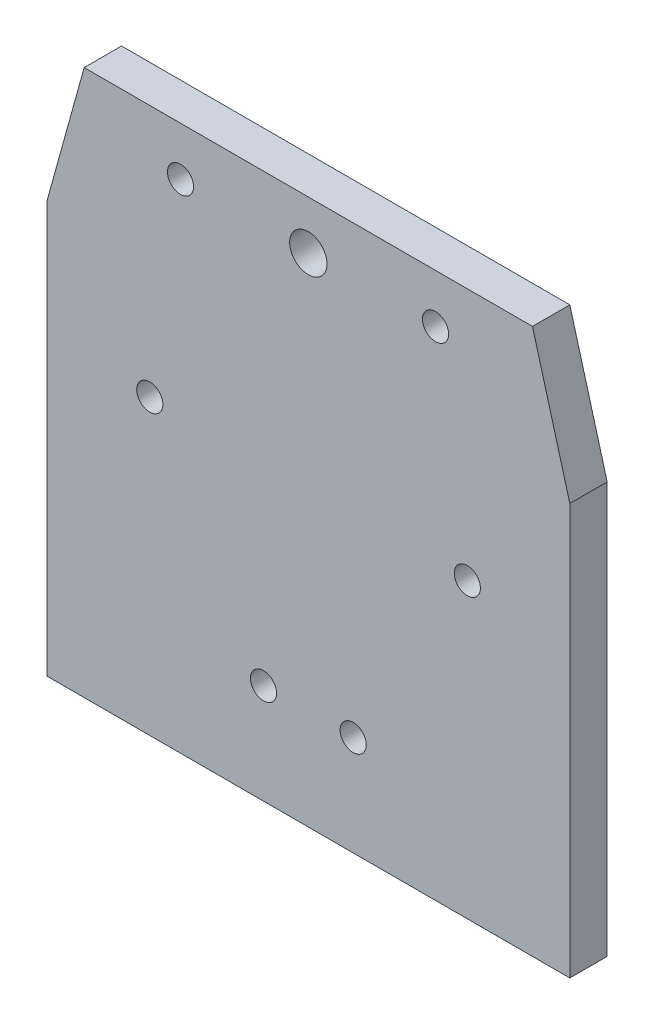
ISO-10303-21;
HEADER;
FILE_DESCRIPTION(('STEP AP214'),'2;1');
FILE_NAME('part.step','',(''),(''),'','','');
FILE_SCHEMA(('AUTOMOTIVE_DESIGN { 1 0 10303 214 1 1 1 1 }'));
ENDSEC;
DATA;
#1=APPLICATION_CONTEXT('core data for automotive mechanical design processes');
#2=APPLICATION_PROTOCOL_DEFINITION('international standard','automotive_design',2000,#1);
#3=PRODUCT_CONTEXT('',#1,'mechanical');
#4=PRODUCT('Part','Part','',(#3));
#5=PRODUCT_RELATED_PRODUCT_CATEGORY('part','',(#4));
#6=PRODUCT_DEFINITION_FORMATION('','',#4);
#7=PRODUCT_DEFINITION_CONTEXT('part definition',#1,'design');
#8=PRODUCT_DEFINITION('design','',#6,#7);
#9=PRODUCT_DEFINITION_SHAPE('','',#8);
#10=(LENGTH_UNIT() NAMED_UNIT(*) SI_UNIT(.MILLI.,.METRE.));
#11=(NAMED_UNIT(*) PLANE_ANGLE_UNIT() SI_UNIT($,.RADIAN.));
#12=(NAMED_UNIT(*) SI_UNIT($,.STERADIAN.) SOLID_ANGLE_UNIT());
#13=UNCERTAINTY_MEASURE_WITH_UNIT(LENGTH_MEASURE(1.E-05),#10,'distance_accuracy_value','');
#14=(GEOMETRIC_REPRESENTATION_CONTEXT(3) GLOBAL_UNCERTAINTY_ASSIGNED_CONTEXT((#13)) GLOBAL_UNIT_ASSIGNED_CONTEXT((#10,
#11,#12)) REPRESENTATION_CONTEXT('',''));
#15=CARTESIAN_POINT('',(0.,0.,0.));
#16=DIRECTION('',(0.,0.,1.));
#17=DIRECTION('',(1.,0.,0.));
#18=AXIS2_PLACEMENT_3D('',#15,#16,#17);
#19=CARTESIAN_POINT('',(0.,0.,5.));
#20=DIRECTION('',(0.,0.,-1.));
#21=DIRECTION('',(-1.,0.,0.));
#22=AXIS2_PLACEMENT_3D('',#19,#20,#21);
#23=PLANE('',#22);
#24=DIRECTION('',(-0.267261241912419,-0.963624111659433,0.));
#25=VECTOR('',#24,1.);
#26=CARTESIAN_POINT('',(364.942546989887,291.200534555619,5.));
#27=LINE('',#26,#25);
#28=CARTESIAN_POINT('',(369.942546989887,309.228290932939,5.));
#29=VERTEX_POINT('',#28);
#30=CARTESIAN_POINT('',(364.942546989887,291.200534555619,5.));
#31=VERTEX_POINT('',#30);
#32=EDGE_CURVE('E129',#29,#31,#27,.T.);
#33=ORIENTED_EDGE('',*,*,#32,.T.);
#34=DIRECTION('',(0.,-1.,0.));
#35=VECTOR('',#34,1.);
#36=CARTESIAN_POINT('',(364.942546989887,236.200534555619,5.));
#37=LINE('',#36,#35);
#38=CARTESIAN_POINT('',(364.942546989887,236.200534555619,5.));
#39=VERTEX_POINT('',#38);
#40=EDGE_CURVE('E87',#31,#39,#37,.T.);
#41=ORIENTED_EDGE('',*,*,#40,.T.);
#42=DIRECTION('',(1.,0.,0.));
#43=VECTOR('',#42,1.);
#44=CARTESIAN_POINT('',(434.942546989887,236.200534555619,5.));
#45=LINE('',#44,#43);
#46=CARTESIAN_POINT('',(434.942546989887,236.200534555619,5.));
#47=VERTEX_POINT('',#46);
#48=EDGE_CURVE('E100',#39,#47,#45,.T.);
#49=ORIENTED_EDGE('',*,*,#48,.T.);
#50=DIRECTION('',(0.,1.,0.));
#51=VECTOR('',#50,1.);
#52=CARTESIAN_POINT('',(434.942546989887,291.200534555619,5.));
#53=LINE('',#52,#51);
#54=CARTESIAN_POINT('',(434.942546989887,291.200534555619,5.));
#55=VERTEX_POINT('',#54);
#56=EDGE_CURVE('E94',#47,#55,#53,.T.);
#57=ORIENTED_EDGE('',*,*,#56,.T.);
#58=DIRECTION('',(-0.267261241912417,0.963624111659434,0.));
#59=VECTOR('',#58,1.);
#60=CARTESIAN_POINT('',(434.942546989887,291.200534555619,5.));
#61=LINE('',#60,#59);
#62=CARTESIAN_POINT('',(429.942546989887,309.228290932939,5.));
#63=VERTEX_POINT('',#62);
#64=EDGE_CURVE('E98',#55,#63,#61,.T.);
#65=ORIENTED_EDGE('',*,*,#64,.T.);
#66=DIRECTION('',(-1.,0.,0.));
#67=VECTOR('',#66,1.);
#68=CARTESIAN_POINT('',(369.942546989887,309.228290932939,5.));
#69=LINE('',#68,#67);
#70=EDGE_CURVE('E50',#63,#29,#69,.T.);
#71=ORIENTED_EDGE('',*,*,#70,.T.);
#72=EDGE_LOOP('',(#33,#41,#49,#57,#65,#71));
#73=FACE_BOUND('',#72,.T.);
#74=CARTESIAN_POINT('',(421.22462876424,275.399946991282,5.));
#75=DIRECTION('',(0.,0.,1.));
#76=DIRECTION('',(1.,0.,0.));
#77=AXIS2_PLACEMENT_3D('',#74,#75,#76);
#78=CIRCLE('',#77,1.74999999999998);
#79=CARTESIAN_POINT('',(422.97462876424,275.399946991282,5.));
#80=VERTEX_POINT('',#79);
#81=EDGE_CURVE('E122',#80,#80,#78,.T.);
#82=ORIENTED_EDGE('',*,*,#81,.F.);
#83=EDGE_LOOP('',(#82));
#84=FACE_BOUND('',#83,.T.);
#85=CARTESIAN_POINT('',(378.72464227775,275.433838704496,5.));
#86=DIRECTION('',(0.,0.,1.));
#87=DIRECTION('',(1.,0.,0.));
#88=AXIS2_PLACEMENT_3D('',#85,#86,#87);
#89=CIRCLE('',#88,1.74999999999998);
#90=CARTESIAN_POINT('',(380.47464227775,275.433838704496,5.));
#91=VERTEX_POINT('',#90);
#92=EDGE_CURVE('E223',#91,#91,#89,.T.);
#93=ORIENTED_EDGE('',*,*,#92,.F.);
#94=EDGE_LOOP('',(#93));
#95=FACE_BOUND('',#94,.T.);
#96=CARTESIAN_POINT('',(393.94592778899,249.582098581531,5.));
#97=DIRECTION('',(0.,0.,1.));
#98=DIRECTION('',(1.,0.,0.));
#99=AXIS2_PLACEMENT_3D('',#96,#97,#98);
#100=CIRCLE('',#99,1.74999999999998);
#101=CARTESIAN_POINT('',(395.695927788989,249.582098581531,5.));
#102=VERTEX_POINT('',#101);
#103=EDGE_CURVE('E217',#102,#102,#100,.T.);
#104=ORIENTED_EDGE('',*,*,#103,.F.);
#105=EDGE_LOOP('',(#104));
#106=FACE_BOUND('',#105,.T.);
#107=CARTESIAN_POINT('',(405.945927788989,249.582098581531,5.));
#108=DIRECTION('',(0.,0.,1.));
#109=DIRECTION('',(1.,0.,0.));
#110=AXIS2_PLACEMENT_3D('',#107,#108,#109);
#111=CIRCLE('',#110,1.74999999999998);
#112=CARTESIAN_POINT('',(407.695927788989,249.582098581531,5.));
#113=VERTEX_POINT('',#112);
#114=EDGE_CURVE('E211',#113,#113,#111,.T.);
#115=ORIENTED_EDGE('',*,*,#114,.F.);
#116=EDGE_LOOP('',(#115));
#117=FACE_BOUND('',#116,.T.);
#118=CARTESIAN_POINT('',(399.942546989887,302.717706752761,5.));
#119=DIRECTION('',(0.,0.,1.));
#120=DIRECTION('',(1.,0.,0.));
#121=AXIS2_PLACEMENT_3D('',#118,#119,#120);
#122=CIRCLE('',#121,2.50000000000008);
#123=CARTESIAN_POINT('',(402.442546989887,302.717706752761,5.));
#124=VERTEX_POINT('',#123);
#125=EDGE_CURVE('E205',#124,#124,#122,.T.);
#126=ORIENTED_EDGE('',*,*,#125,.F.);
#127=EDGE_LOOP('',(#126));
#128=FACE_BOUND('',#127,.T.);
#129=CARTESIAN_POINT('',(382.836160520448,302.717706752761,5.));
#130=DIRECTION('',(0.,0.,1.));
#131=DIRECTION('',(1.,0.,0.));
#132=AXIS2_PLACEMENT_3D('',#129,#130,#131);
#133=CIRCLE('',#132,1.74999999999998);
#134=CARTESIAN_POINT('',(384.586160520448,302.717706752761,5.));
#135=VERTEX_POINT('',#134);
#136=EDGE_CURVE('E199',#135,#135,#133,.T.);
#137=ORIENTED_EDGE('',*,*,#136,.F.);
#138=EDGE_LOOP('',(#137));
#139=FACE_BOUND('',#138,.T.);
#140=CARTESIAN_POINT('',(416.968403725981,302.717706752761,5.));
#141=DIRECTION('',(0.,0.,1.));
#142=DIRECTION('',(1.,0.,0.));
#143=AXIS2_PLACEMENT_3D('',#140,#141,#142);
#144=CIRCLE('',#143,1.74999999999998);
#145=CARTESIAN_POINT('',(418.718403725981,302.717706752761,5.));
#146=VERTEX_POINT('',#145);
#147=EDGE_CURVE('E190',#146,#146,#144,.T.);
#148=ORIENTED_EDGE('',*,*,#147,.F.);
#149=EDGE_LOOP('',(#148));
#150=FACE_BOUND('',#149,.T.);
#151=ADVANCED_FACE('F33',(#73,#84,#95,#106,#117,#128,#139,#150),#23,.F.);
#152=CARTESIAN_POINT('',(0.,0.,0.));
#153=DIRECTION('',(0.,0.,-1.));
#154=DIRECTION('',(-1.,0.,0.));
#155=AXIS2_PLACEMENT_3D('',#152,#153,#154);
#156=PLANE('',#155);
#157=CARTESIAN_POINT('',(382.836160520448,302.717706752761,0.));
#158=DIRECTION('',(0.,0.,1.));
#159=DIRECTION('',(1.,0.,0.));
#160=AXIS2_PLACEMENT_3D('',#157,#158,#159);
#161=CIRCLE('',#160,1.74999999999998);
#162=CARTESIAN_POINT('',(384.586160520448,302.717706752761,0.));
#163=VERTEX_POINT('',#162);
#164=EDGE_CURVE('E196',#163,#163,#161,.T.);
#165=ORIENTED_EDGE('',*,*,#164,.T.);
#166=EDGE_LOOP('',(#165));
#167=FACE_BOUND('',#166,.T.);
#168=CARTESIAN_POINT('',(405.945927788989,249.582098581531,0.));
#169=DIRECTION('',(0.,0.,1.));
#170=DIRECTION('',(1.,0.,0.));
#171=AXIS2_PLACEMENT_3D('',#168,#169,#170);
#172=CIRCLE('',#171,1.74999999999998);
#173=CARTESIAN_POINT('',(407.695927788989,249.582098581531,0.));
#174=VERTEX_POINT('',#173);
#175=EDGE_CURVE('E208',#174,#174,#172,.T.);
#176=ORIENTED_EDGE('',*,*,#175,.T.);
#177=EDGE_LOOP('',(#176));
#178=FACE_BOUND('',#177,.T.);
#179=CARTESIAN_POINT('',(378.72464227775,275.433838704496,0.));
#180=DIRECTION('',(0.,0.,1.));
#181=DIRECTION('',(1.,0.,0.));
#182=AXIS2_PLACEMENT_3D('',#179,#180,#181);
#183=CIRCLE('',#182,1.74999999999998);
#184=CARTESIAN_POINT('',(380.47464227775,275.433838704496,0.));
#185=VERTEX_POINT('',#184);
#186=EDGE_CURVE('E220',#185,#185,#183,.T.);
#187=ORIENTED_EDGE('',*,*,#186,.T.);
#188=EDGE_LOOP('',(#187));
#189=FACE_BOUND('',#188,.T.);
#190=DIRECTION('',(-0.267261241912419,-0.963624111659433,0.));
#191=VECTOR('',#190,1.);
#192=CARTESIAN_POINT('',(364.942546989887,291.200534555619,0.));
#193=LINE('',#192,#191);
#194=CARTESIAN_POINT('',(369.942546989887,309.228290932939,0.));
#195=VERTEX_POINT('',#194);
#196=CARTESIAN_POINT('',(364.942546989887,291.200534555619,0.));
#197=VERTEX_POINT('',#196);
#198=EDGE_CURVE('E118',#195,#197,#193,.T.);
#199=ORIENTED_EDGE('',*,*,#198,.F.);
#200=DIRECTION('',(-1.,0.,0.));
#201=VECTOR('',#200,1.);
#202=CARTESIAN_POINT('',(369.942546989887,309.228290932939,0.));
#203=LINE('',#202,#201);
#204=CARTESIAN_POINT('',(429.942546989887,309.228290932939,0.));
#205=VERTEX_POINT('',#204);
#206=EDGE_CURVE('E79',#205,#195,#203,.T.);
#207=ORIENTED_EDGE('',*,*,#206,.F.);
#208=DIRECTION('',(-0.267261241912417,0.963624111659434,0.));
#209=VECTOR('',#208,1.);
#210=CARTESIAN_POINT('',(434.942546989887,291.200534555619,0.));
#211=LINE('',#210,#209);
#212=CARTESIAN_POINT('',(434.942546989887,291.200534555619,0.));
#213=VERTEX_POINT('',#212);
#214=EDGE_CURVE('E73',#213,#205,#211,.T.);
#215=ORIENTED_EDGE('',*,*,#214,.F.);
#216=DIRECTION('',(0.,1.,0.));
#217=VECTOR('',#216,1.);
#218=CARTESIAN_POINT('',(434.942546989887,291.200534555619,0.));
#219=LINE('',#218,#217);
#220=CARTESIAN_POINT('',(434.942546989887,236.200534555619,0.));
#221=VERTEX_POINT('',#220);
#222=EDGE_CURVE('E108',#221,#213,#219,.T.);
#223=ORIENTED_EDGE('',*,*,#222,.F.);
#224=DIRECTION('',(1.,0.,0.));
#225=VECTOR('',#224,1.);
#226=CARTESIAN_POINT('',(434.942546989887,236.200534555619,0.));
#227=LINE('',#226,#225);
#228=CARTESIAN_POINT('',(364.942546989887,236.200534555619,0.));
#229=VERTEX_POINT('',#228);
#230=EDGE_CURVE('E124',#229,#221,#227,.T.);
#231=ORIENTED_EDGE('',*,*,#230,.F.);
#232=DIRECTION('',(0.,-1.,0.));
#233=VECTOR('',#232,1.);
#234=CARTESIAN_POINT('',(364.942546989887,236.200534555619,0.));
#235=LINE('',#234,#233);
#236=EDGE_CURVE('E121',#197,#229,#235,.T.);
#237=ORIENTED_EDGE('',*,*,#236,.F.);
#238=EDGE_LOOP('',(#199,#207,#215,#223,#231,#237));
#239=FACE_BOUND('',#238,.T.);
#240=CARTESIAN_POINT('',(421.22462876424,275.399946991282,0.));
#241=DIRECTION('',(0.,0.,1.));
#242=DIRECTION('',(1.,0.,0.));
#243=AXIS2_PLACEMENT_3D('',#240,#241,#242);
#244=CIRCLE('',#243,1.74999999999998);
#245=CARTESIAN_POINT('',(422.97462876424,275.399946991282,0.));
#246=VERTEX_POINT('',#245);
#247=EDGE_CURVE('E226',#246,#246,#244,.T.);
#248=ORIENTED_EDGE('',*,*,#247,.T.);
#249=EDGE_LOOP('',(#248));
#250=FACE_BOUND('',#249,.T.);
#251=CARTESIAN_POINT('',(393.94592778899,249.582098581531,0.));
#252=DIRECTION('',(0.,0.,1.));
#253=DIRECTION('',(1.,0.,0.));
#254=AXIS2_PLACEMENT_3D('',#251,#252,#253);
#255=CIRCLE('',#254,1.74999999999998);
#256=CARTESIAN_POINT('',(395.695927788989,249.582098581531,0.));
#257=VERTEX_POINT('',#256);
#258=EDGE_CURVE('E214',#257,#257,#255,.T.);
#259=ORIENTED_EDGE('',*,*,#258,.T.);
#260=EDGE_LOOP('',(#259));
#261=FACE_BOUND('',#260,.T.);
#262=CARTESIAN_POINT('',(399.942546989887,302.717706752761,0.));
#263=DIRECTION('',(0.,0.,1.));
#264=DIRECTION('',(1.,0.,0.));
#265=AXIS2_PLACEMENT_3D('',#262,#263,#264);
#266=CIRCLE('',#265,2.50000000000008);
#267=CARTESIAN_POINT('',(402.442546989887,302.717706752761,0.));
#268=VERTEX_POINT('',#267);
#269=EDGE_CURVE('E202',#268,#268,#266,.T.);
#270=ORIENTED_EDGE('',*,*,#269,.T.);
#271=EDGE_LOOP('',(#270));
#272=FACE_BOUND('',#271,.T.);
#273=CARTESIAN_POINT('',(416.968403725981,302.717706752761,0.));
#274=DIRECTION('',(0.,0.,1.));
#275=DIRECTION('',(1.,0.,0.));
#276=AXIS2_PLACEMENT_3D('',#273,#274,#275);
#277=CIRCLE('',#276,1.74999999999998);
#278=CARTESIAN_POINT('',(418.718403725981,302.717706752761,0.));
#279=VERTEX_POINT('',#278);
#280=EDGE_CURVE('E193',#279,#279,#277,.T.);
#281=ORIENTED_EDGE('',*,*,#280,.T.);
#282=EDGE_LOOP('',(#281));
#283=FACE_BOUND('',#282,.T.);
#284=ADVANCED_FACE('F138',(#167,#178,#189,#239,#250,#261,#272,#283),#156,.T.);
#285=CARTESIAN_POINT('',(364.942546989887,291.200534555619,5.));
#286=DIRECTION('',(0.963624111659433,-0.267261241912419,0.));
#287=DIRECTION('',(0.267261241912419,0.963624111659433,0.));
#288=AXIS2_PLACEMENT_3D('',#285,#286,#287);
#289=PLANE('',#288);
#290=ORIENTED_EDGE('',*,*,#198,.T.);
#291=DIRECTION('',(0.,0.,-1.));
#292=VECTOR('',#291,1.);
#293=CARTESIAN_POINT('',(364.942546989887,291.200534555619,5.));
#294=LINE('',#293,#292);
#295=EDGE_CURVE('E11',#31,#197,#294,.T.);
#296=ORIENTED_EDGE('',*,*,#295,.F.);
#297=ORIENTED_EDGE('',*,*,#32,.F.);
#298=DIRECTION('',(0.,0.,-1.));
#299=VECTOR('',#298,1.);
#300=CARTESIAN_POINT('',(369.942546989887,309.228290932939,5.));
#301=LINE('',#300,#299);
#302=EDGE_CURVE('E114',#29,#195,#301,.T.);
#303=ORIENTED_EDGE('',*,*,#302,.T.);
#304=EDGE_LOOP('',(#290,#296,#297,#303));
#305=FACE_BOUND('',#304,.T.);
#306=ADVANCED_FACE('F35',(#305),#289,.F.);
#307=CARTESIAN_POINT('',(364.942546989887,236.200534555619,5.));
#308=DIRECTION('',(1.,0.,0.));
#309=DIRECTION('',(0.,1.,0.));
#310=AXIS2_PLACEMENT_3D('',#307,#308,#309);
#311=PLANE('',#310);
#312=ORIENTED_EDGE('',*,*,#236,.T.);
#313=DIRECTION('',(0.,0.,-1.));
#314=VECTOR('',#313,1.);
#315=CARTESIAN_POINT('',(364.942546989887,236.200534555619,5.));
#316=LINE('',#315,#314);
#317=EDGE_CURVE('E42',#39,#229,#316,.T.);
#318=ORIENTED_EDGE('',*,*,#317,.F.);
#319=ORIENTED_EDGE('',*,*,#40,.F.);
#320=ORIENTED_EDGE('',*,*,#295,.T.);
#321=EDGE_LOOP('',(#312,#318,#319,#320));
#322=FACE_BOUND('',#321,.T.);
#323=ADVANCED_FACE('F313',(#322),#311,.F.);
#324=CARTESIAN_POINT('',(434.942546989887,236.200534555619,5.));
#325=DIRECTION('',(0.,1.,0.));
#326=DIRECTION('',(0.,0.,1.));
#327=AXIS2_PLACEMENT_3D('',#324,#325,#326);
#328=PLANE('',#327);
#329=ORIENTED_EDGE('',*,*,#230,.T.);
#330=DIRECTION('',(0.,0.,-1.));
#331=VECTOR('',#330,1.);
#332=CARTESIAN_POINT('',(434.942546989887,236.200534555619,5.));
#333=LINE('',#332,#331);
#334=EDGE_CURVE('E109',#47,#221,#333,.T.);
#335=ORIENTED_EDGE('',*,*,#334,.F.);
#336=ORIENTED_EDGE('',*,*,#48,.F.);
#337=ORIENTED_EDGE('',*,*,#317,.T.);
#338=EDGE_LOOP('',(#329,#335,#336,#337));
#339=FACE_BOUND('',#338,.T.);
#340=ADVANCED_FACE('F135',(#339),#328,.F.);
#341=CARTESIAN_POINT('',(434.942546989887,291.200534555619,5.));
#342=DIRECTION('',(-1.,0.,0.));
#343=DIRECTION('',(0.,-1.,0.));
#344=AXIS2_PLACEMENT_3D('',#341,#342,#343);
#345=PLANE('',#344);
#346=ORIENTED_EDGE('',*,*,#222,.T.);
#347=DIRECTION('',(0.,0.,-1.));
#348=VECTOR('',#347,1.);
#349=CARTESIAN_POINT('',(434.942546989887,291.200534555619,5.));
#350=LINE('',#349,#348);
#351=EDGE_CURVE('E105',#55,#213,#350,.T.);
#352=ORIENTED_EDGE('',*,*,#351,.F.);
#353=ORIENTED_EDGE('',*,*,#56,.F.);
#354=ORIENTED_EDGE('',*,*,#334,.T.);
#355=EDGE_LOOP('',(#346,#352,#353,#354));
#356=FACE_BOUND('',#355,.T.);
#357=ADVANCED_FACE('F106',(#356),#345,.F.);
#358=CARTESIAN_POINT('',(434.942546989887,291.200534555619,5.));
#359=DIRECTION('',(-0.963624111659434,-0.267261241912417,0.));
#360=DIRECTION('',(0.267261241912417,-0.963624111659434,0.));
#361=AXIS2_PLACEMENT_3D('',#358,#359,#360);
#362=PLANE('',#361);
#363=ORIENTED_EDGE('',*,*,#214,.T.);
#364=DIRECTION('',(0.,0.,-1.));
#365=VECTOR('',#364,1.);
#366=CARTESIAN_POINT('',(429.942546989887,309.228290932939,5.));
#367=LINE('',#366,#365);
#368=EDGE_CURVE('E110',#63,#205,#367,.T.);
#369=ORIENTED_EDGE('',*,*,#368,.F.);
#370=ORIENTED_EDGE('',*,*,#64,.F.);
#371=ORIENTED_EDGE('',*,*,#351,.T.);
#372=EDGE_LOOP('',(#363,#369,#370,#371));
#373=FACE_BOUND('',#372,.T.);
#374=ADVANCED_FACE('F112',(#373),#362,.F.);
#375=CARTESIAN_POINT('',(369.942546989887,309.228290932939,5.));
#376=DIRECTION('',(0.,-1.,0.));
#377=DIRECTION('',(1.,0.,0.));
#378=AXIS2_PLACEMENT_3D('',#375,#376,#377);
#379=PLANE('',#378);
#380=ORIENTED_EDGE('',*,*,#206,.T.);
#381=ORIENTED_EDGE('',*,*,#302,.F.);
#382=ORIENTED_EDGE('',*,*,#70,.F.);
#383=ORIENTED_EDGE('',*,*,#368,.T.);
#384=EDGE_LOOP('',(#380,#381,#382,#383));
#385=FACE_BOUND('',#384,.T.);
#386=ADVANCED_FACE('F143',(#385),#379,.F.);
#387=CARTESIAN_POINT('',(421.22462876424,275.399946991282,5.));
#388=DIRECTION('',(0.,0.,-1.));
#389=DIRECTION('',(-1.,0.,0.));
#390=AXIS2_PLACEMENT_3D('',#387,#388,#389);
#391=CYLINDRICAL_SURFACE('',#390,1.74999999999998);
#392=ORIENTED_EDGE('',*,*,#81,.T.);
#393=EDGE_LOOP('',(#392));
#394=FACE_BOUND('',#393,.T.);
#395=ORIENTED_EDGE('',*,*,#247,.F.);
#396=EDGE_LOOP('',(#395));
#397=FACE_BOUND('',#396,.T.);
#398=ADVANCED_FACE('F145',(#394,#397),#391,.F.);
#399=CARTESIAN_POINT('',(378.72464227775,275.433838704496,5.));
#400=DIRECTION('',(0.,0.,-1.));
#401=DIRECTION('',(-1.,0.,0.));
#402=AXIS2_PLACEMENT_3D('',#399,#400,#401);
#403=CYLINDRICAL_SURFACE('',#402,1.74999999999998);
#404=ORIENTED_EDGE('',*,*,#92,.T.);
#405=EDGE_LOOP('',(#404));
#406=FACE_BOUND('',#405,.T.);
#407=ORIENTED_EDGE('',*,*,#186,.F.);
#408=EDGE_LOOP('',(#407));
#409=FACE_BOUND('',#408,.T.);
#410=ADVANCED_FACE('F151',(#406,#409),#403,.F.);
#411=CARTESIAN_POINT('',(393.94592778899,249.582098581531,5.));
#412=DIRECTION('',(0.,0.,-1.));
#413=DIRECTION('',(-1.,0.,0.));
#414=AXIS2_PLACEMENT_3D('',#411,#412,#413);
#415=CYLINDRICAL_SURFACE('',#414,1.74999999999998);
#416=ORIENTED_EDGE('',*,*,#103,.T.);
#417=EDGE_LOOP('',(#416));
#418=FACE_BOUND('',#417,.T.);
#419=ORIENTED_EDGE('',*,*,#258,.F.);
#420=EDGE_LOOP('',(#419));
#421=FACE_BOUND('',#420,.T.);
#422=ADVANCED_FACE('F165',(#418,#421),#415,.F.);
#423=CARTESIAN_POINT('',(405.945927788989,249.582098581531,5.));
#424=DIRECTION('',(0.,0.,-1.));
#425=DIRECTION('',(-1.,0.,0.));
#426=AXIS2_PLACEMENT_3D('',#423,#424,#425);
#427=CYLINDRICAL_SURFACE('',#426,1.74999999999998);
#428=ORIENTED_EDGE('',*,*,#114,.T.);
#429=EDGE_LOOP('',(#428));
#430=FACE_BOUND('',#429,.T.);
#431=ORIENTED_EDGE('',*,*,#175,.F.);
#432=EDGE_LOOP('',(#431));
#433=FACE_BOUND('',#432,.T.);
#434=ADVANCED_FACE('F169',(#430,#433),#427,.F.);
#435=CARTESIAN_POINT('',(399.942546989887,302.717706752761,5.));
#436=DIRECTION('',(0.,0.,-1.));
#437=DIRECTION('',(-1.,0.,0.));
#438=AXIS2_PLACEMENT_3D('',#435,#436,#437);
#439=CYLINDRICAL_SURFACE('',#438,2.50000000000008);
#440=ORIENTED_EDGE('',*,*,#125,.T.);
#441=EDGE_LOOP('',(#440));
#442=FACE_BOUND('',#441,.T.);
#443=ORIENTED_EDGE('',*,*,#269,.F.);
#444=EDGE_LOOP('',(#443));
#445=FACE_BOUND('',#444,.T.);
#446=ADVANCED_FACE('F173',(#442,#445),#439,.F.);
#447=CARTESIAN_POINT('',(382.836160520448,302.717706752761,5.));
#448=DIRECTION('',(0.,0.,-1.));
#449=DIRECTION('',(-1.,0.,0.));
#450=AXIS2_PLACEMENT_3D('',#447,#448,#449);
#451=CYLINDRICAL_SURFACE('',#450,1.74999999999998);
#452=ORIENTED_EDGE('',*,*,#136,.T.);
#453=EDGE_LOOP('',(#452));
#454=FACE_BOUND('',#453,.T.);
#455=ORIENTED_EDGE('',*,*,#164,.F.);
#456=EDGE_LOOP('',(#455));
#457=FACE_BOUND('',#456,.T.);
#458=ADVANCED_FACE('F177',(#454,#457),#451,.F.);
#459=CARTESIAN_POINT('',(416.968403725981,302.717706752761,5.));
#460=DIRECTION('',(0.,0.,-1.));
#461=DIRECTION('',(-1.,0.,0.));
#462=AXIS2_PLACEMENT_3D('',#459,#460,#461);
#463=CYLINDRICAL_SURFACE('',#462,1.74999999999998);
#464=ORIENTED_EDGE('',*,*,#147,.T.);
#465=EDGE_LOOP('',(#464));
#466=FACE_BOUND('',#465,.T.);
#467=ORIENTED_EDGE('',*,*,#280,.F.);
#468=EDGE_LOOP('',(#467));
#469=FACE_BOUND('',#468,.T.);
#470=ADVANCED_FACE('F181',(#466,#469),#463,.F.);
#471=CLOSED_SHELL('',(#151,#284,#306,#323,#340,#357,#374,#386,#398,#410,#422,#434,#446,#458,#470));
#472=MANIFOLD_SOLID_BREP('B2',#471);
#473=ADVANCED_BREP_SHAPE_REPRESENTATION('',(#18,#472),#14);
#474=SHAPE_DEFINITION_REPRESENTATION(#9,#473);
ENDSEC;
END-ISO-10303-21;
